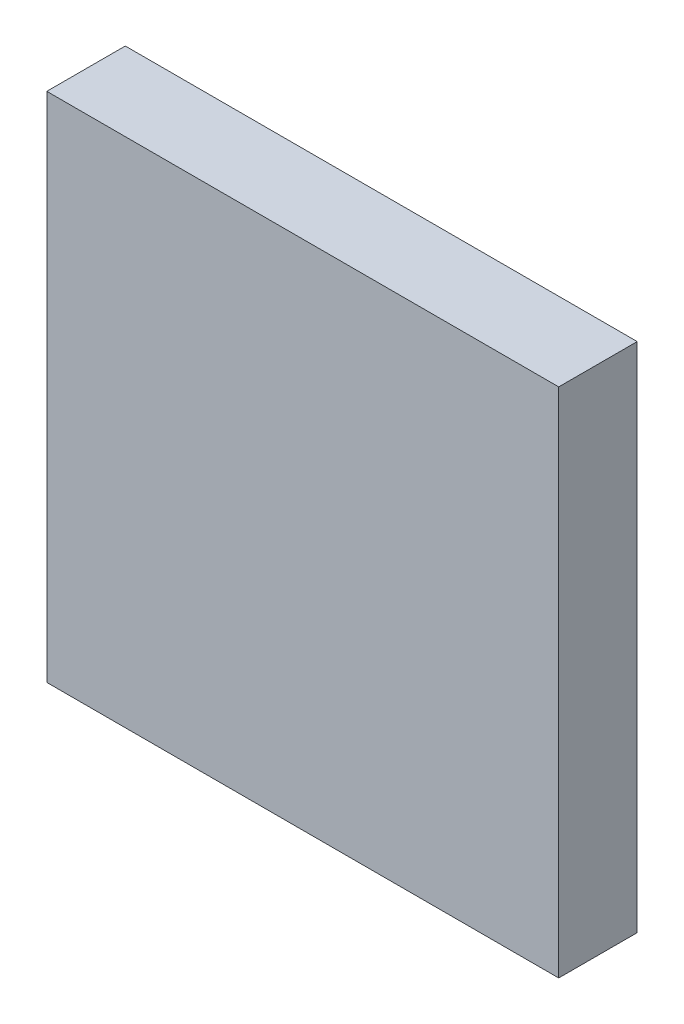
ISO-10303-21;
HEADER;
FILE_DESCRIPTION(('STEP AP214'),'2;1');
FILE_NAME('part.step','',(''),(''),'','','');
FILE_SCHEMA(('AUTOMOTIVE_DESIGN { 1 0 10303 214 1 1 1 1 }'));
ENDSEC;
DATA;
#1=APPLICATION_CONTEXT('core data for automotive mechanical design processes');
#2=APPLICATION_PROTOCOL_DEFINITION('international standard','automotive_design',2000,#1);
#3=PRODUCT_CONTEXT('',#1,'mechanical');
#4=PRODUCT('Part','Part','',(#3));
#5=PRODUCT_RELATED_PRODUCT_CATEGORY('part','',(#4));
#6=PRODUCT_DEFINITION_FORMATION('','',#4);
#7=PRODUCT_DEFINITION_CONTEXT('part definition',#1,'design');
#8=PRODUCT_DEFINITION('design','',#6,#7);
#9=PRODUCT_DEFINITION_SHAPE('','',#8);
#10=(LENGTH_UNIT() NAMED_UNIT(*) SI_UNIT(.MILLI.,.METRE.));
#11=(NAMED_UNIT(*) PLANE_ANGLE_UNIT() SI_UNIT($,.RADIAN.));
#12=(NAMED_UNIT(*) SI_UNIT($,.STERADIAN.) SOLID_ANGLE_UNIT());
#13=UNCERTAINTY_MEASURE_WITH_UNIT(LENGTH_MEASURE(1.E-05),#10,'distance_accuracy_value','');
#14=(GEOMETRIC_REPRESENTATION_CONTEXT(3) GLOBAL_UNCERTAINTY_ASSIGNED_CONTEXT((#13)) GLOBAL_UNIT_ASSIGNED_CONTEXT((#10,
#11,#12)) REPRESENTATION_CONTEXT('',''));
#15=CARTESIAN_POINT('',(0.,0.,0.));
#16=DIRECTION('',(0.,0.,1.));
#17=DIRECTION('',(1.,0.,0.));
#18=AXIS2_PLACEMENT_3D('',#15,#16,#17);
#19=CARTESIAN_POINT('',(46.8074919711418,38.2816209172633,2.3));
#20=DIRECTION('',(1.,0.,0.));
#21=DIRECTION('',(0.,1.,0.));
#22=AXIS2_PLACEMENT_3D('',#19,#20,#21);
#23=PLANE('',#22);
#24=DIRECTION('',(0.,-1.,0.));
#25=VECTOR('',#24,1.);
#26=CARTESIAN_POINT('',(46.8074919711418,38.2816209172633,0.));
#27=LINE('',#26,#25);
#28=CARTESIAN_POINT('',(46.8074919711418,38.2816209172633,0.));
#29=VERTEX_POINT('',#28);
#30=CARTESIAN_POINT('',(46.8074919711419,23.2816209172633,0.));
#31=VERTEX_POINT('',#30);
#32=EDGE_CURVE('E100',#29,#31,#27,.T.);
#33=ORIENTED_EDGE('',*,*,#32,.T.);
#34=DIRECTION('',(0.,0.,-1.));
#35=VECTOR('',#34,1.);
#36=CARTESIAN_POINT('',(46.8074919711419,23.2816209172633,2.3));
#37=LINE('',#36,#35);
#38=CARTESIAN_POINT('',(46.8074919711419,23.2816209172633,2.3));
#39=VERTEX_POINT('',#38);
#40=EDGE_CURVE('E11',#39,#31,#37,.T.);
#41=ORIENTED_EDGE('',*,*,#40,.F.);
#42=DIRECTION('',(0.,-1.,0.));
#43=VECTOR('',#42,1.);
#44=CARTESIAN_POINT('',(46.8074919711418,38.2816209172633,2.3));
#45=LINE('',#44,#43);
#46=CARTESIAN_POINT('',(46.8074919711418,38.2816209172633,2.3));
#47=VERTEX_POINT('',#46);
#48=EDGE_CURVE('E88',#47,#39,#45,.T.);
#49=ORIENTED_EDGE('',*,*,#48,.F.);
#50=DIRECTION('',(0.,0.,-1.));
#51=VECTOR('',#50,1.);
#52=CARTESIAN_POINT('',(46.8074919711418,38.2816209172633,2.3));
#53=LINE('',#52,#51);
#54=EDGE_CURVE('E96',#47,#29,#53,.T.);
#55=ORIENTED_EDGE('',*,*,#54,.T.);
#56=EDGE_LOOP('',(#33,#41,#49,#55));
#57=FACE_BOUND('',#56,.T.);
#58=ADVANCED_FACE('F37',(#57),#23,.F.);
#59=CARTESIAN_POINT('',(46.8074919711419,23.2816209172633,2.3));
#60=DIRECTION('',(0.,1.,0.));
#61=DIRECTION('',(0.,0.,1.));
#62=AXIS2_PLACEMENT_3D('',#59,#60,#61);
#63=PLANE('',#62);
#64=DIRECTION('',(1.,0.,0.));
#65=VECTOR('',#64,1.);
#66=CARTESIAN_POINT('',(46.8074919711419,23.2816209172633,0.));
#67=LINE('',#66,#65);
#68=CARTESIAN_POINT('',(61.8074919711418,23.2816209172633,0.));
#69=VERTEX_POINT('',#68);
#70=EDGE_CURVE('E92',#31,#69,#67,.T.);
#71=ORIENTED_EDGE('',*,*,#70,.T.);
#72=DIRECTION('',(0.,0.,-1.));
#73=VECTOR('',#72,1.);
#74=CARTESIAN_POINT('',(61.8074919711418,23.2816209172633,2.3));
#75=LINE('',#74,#73);
#76=CARTESIAN_POINT('',(61.8074919711418,23.2816209172633,2.3));
#77=VERTEX_POINT('',#76);
#78=EDGE_CURVE('E45',#77,#69,#75,.T.);
#79=ORIENTED_EDGE('',*,*,#78,.F.);
#80=DIRECTION('',(1.,0.,0.));
#81=VECTOR('',#80,1.);
#82=CARTESIAN_POINT('',(46.8074919711419,23.2816209172633,2.3));
#83=LINE('',#82,#81);
#84=EDGE_CURVE('E83',#39,#77,#83,.T.);
#85=ORIENTED_EDGE('',*,*,#84,.F.);
#86=ORIENTED_EDGE('',*,*,#40,.T.);
#87=EDGE_LOOP('',(#71,#79,#85,#86));
#88=FACE_BOUND('',#87,.T.);
#89=ADVANCED_FACE('F91',(#88),#63,.F.);
#90=CARTESIAN_POINT('',(61.8074919711418,38.2816209172633,2.3));
#91=DIRECTION('',(-1.,0.,0.));
#92=DIRECTION('',(0.,-1.,0.));
#93=AXIS2_PLACEMENT_3D('',#90,#91,#92);
#94=PLANE('',#93);
#95=DIRECTION('',(0.,1.,0.));
#96=VECTOR('',#95,1.);
#97=CARTESIAN_POINT('',(61.8074919711418,38.2816209172633,0.));
#98=LINE('',#97,#96);
#99=CARTESIAN_POINT('',(61.8074919711418,38.2816209172633,0.));
#100=VERTEX_POINT('',#99);
#101=EDGE_CURVE('E70',#69,#100,#98,.T.);
#102=ORIENTED_EDGE('',*,*,#101,.T.);
#103=DIRECTION('',(0.,0.,-1.));
#104=VECTOR('',#103,1.);
#105=CARTESIAN_POINT('',(61.8074919711418,38.2816209172633,2.3));
#106=LINE('',#105,#104);
#107=CARTESIAN_POINT('',(61.8074919711418,38.2816209172633,2.3));
#108=VERTEX_POINT('',#107);
#109=EDGE_CURVE('E93',#108,#100,#106,.T.);
#110=ORIENTED_EDGE('',*,*,#109,.F.);
#111=DIRECTION('',(0.,1.,0.));
#112=VECTOR('',#111,1.);
#113=CARTESIAN_POINT('',(61.8074919711418,38.2816209172633,2.3));
#114=LINE('',#113,#112);
#115=EDGE_CURVE('E86',#77,#108,#114,.T.);
#116=ORIENTED_EDGE('',*,*,#115,.F.);
#117=ORIENTED_EDGE('',*,*,#78,.T.);
#118=EDGE_LOOP('',(#102,#110,#116,#117));
#119=FACE_BOUND('',#118,.T.);
#120=ADVANCED_FACE('F94',(#119),#94,.F.);
#121=CARTESIAN_POINT('',(46.8074919711418,38.2816209172633,2.3));
#122=DIRECTION('',(0.,-1.,0.));
#123=DIRECTION('',(1.,0.,0.));
#124=AXIS2_PLACEMENT_3D('',#121,#122,#123);
#125=PLANE('',#124);
#126=DIRECTION('',(-1.,0.,0.));
#127=VECTOR('',#126,1.);
#128=CARTESIAN_POINT('',(46.8074919711418,38.2816209172633,0.));
#129=LINE('',#128,#127);
#130=EDGE_CURVE('E76',#100,#29,#129,.T.);
#131=ORIENTED_EDGE('',*,*,#130,.T.);
#132=ORIENTED_EDGE('',*,*,#54,.F.);
#133=DIRECTION('',(-1.,0.,0.));
#134=VECTOR('',#133,1.);
#135=CARTESIAN_POINT('',(46.8074919711418,38.2816209172633,2.3));
#136=LINE('',#135,#134);
#137=EDGE_CURVE('E53',#108,#47,#136,.T.);
#138=ORIENTED_EDGE('',*,*,#137,.F.);
#139=ORIENTED_EDGE('',*,*,#109,.T.);
#140=EDGE_LOOP('',(#131,#132,#138,#139));
#141=FACE_BOUND('',#140,.T.);
#142=ADVANCED_FACE('F107',(#141),#125,.F.);
#143=CARTESIAN_POINT('',(0.,0.,2.3));
#144=DIRECTION('',(0.,0.,1.));
#145=DIRECTION('',(1.,0.,0.));
#146=AXIS2_PLACEMENT_3D('',#143,#144,#145);
#147=PLANE('',#146);
#148=ORIENTED_EDGE('',*,*,#48,.T.);
#149=ORIENTED_EDGE('',*,*,#84,.T.);
#150=ORIENTED_EDGE('',*,*,#115,.T.);
#151=ORIENTED_EDGE('',*,*,#137,.T.);
#152=EDGE_LOOP('',(#148,#149,#150,#151));
#153=FACE_BOUND('',#152,.T.);
#154=ADVANCED_FACE('F84',(#153),#147,.T.);
#155=CARTESIAN_POINT('',(0.,0.,0.));
#156=DIRECTION('',(0.,0.,1.));
#157=DIRECTION('',(1.,0.,0.));
#158=AXIS2_PLACEMENT_3D('',#155,#156,#157);
#159=PLANE('',#158);
#160=ORIENTED_EDGE('',*,*,#32,.F.);
#161=ORIENTED_EDGE('',*,*,#130,.F.);
#162=ORIENTED_EDGE('',*,*,#101,.F.);
#163=ORIENTED_EDGE('',*,*,#70,.F.);
#164=EDGE_LOOP('',(#160,#161,#162,#163));
#165=FACE_BOUND('',#164,.T.);
#166=ADVANCED_FACE('F110',(#165),#159,.F.);
#167=CLOSED_SHELL('',(#58,#89,#120,#142,#154,#166));
#168=MANIFOLD_SOLID_BREP('B2',#167);
#169=ADVANCED_BREP_SHAPE_REPRESENTATION('',(#18,#168),#14);
#170=SHAPE_DEFINITION_REPRESENTATION(#9,#169);
ENDSEC;
END-ISO-10303-21;
